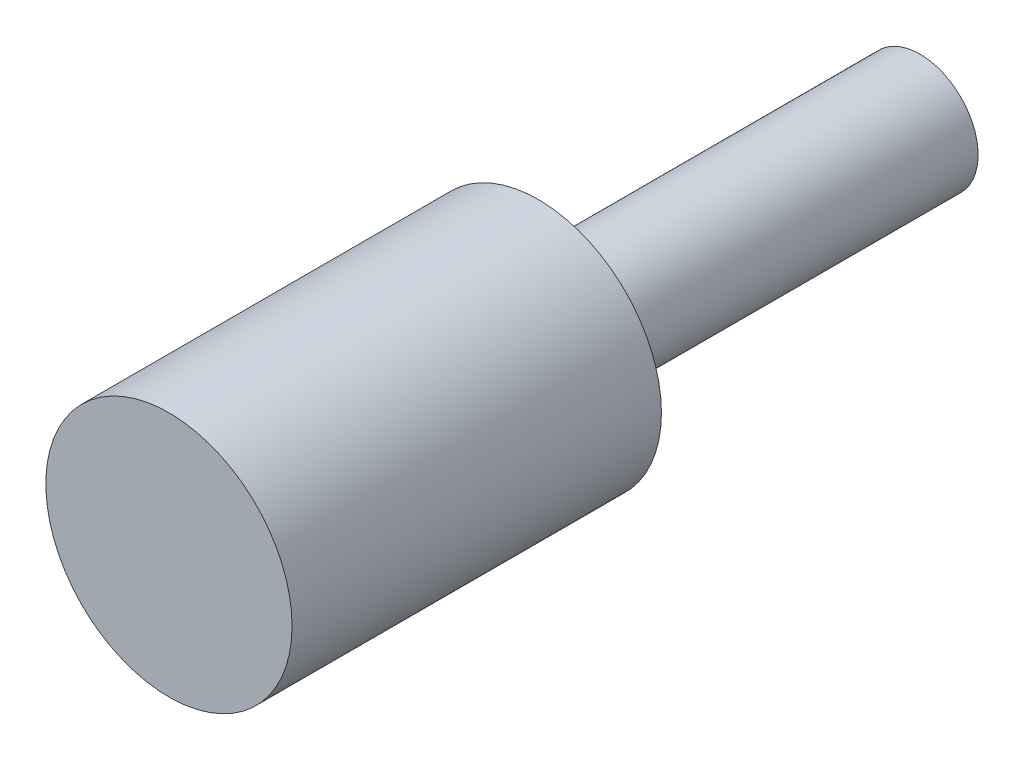
ISO-10303-21;
HEADER;
FILE_DESCRIPTION(('STEP AP214'),'2;1');
FILE_NAME('part.step','',(''),(''),'','','');
FILE_SCHEMA(('AUTOMOTIVE_DESIGN { 1 0 10303 214 1 1 1 1 }'));
ENDSEC;
DATA;
#1=APPLICATION_CONTEXT('core data for automotive mechanical design processes');
#2=APPLICATION_PROTOCOL_DEFINITION('international standard','automotive_design',2000,#1);
#3=PRODUCT_CONTEXT('',#1,'mechanical');
#4=PRODUCT('Part','Part','',(#3));
#5=PRODUCT_RELATED_PRODUCT_CATEGORY('part','',(#4));
#6=PRODUCT_DEFINITION_FORMATION('','',#4);
#7=PRODUCT_DEFINITION_CONTEXT('part definition',#1,'design');
#8=PRODUCT_DEFINITION('design','',#6,#7);
#9=PRODUCT_DEFINITION_SHAPE('','',#8);
#10=(LENGTH_UNIT() NAMED_UNIT(*) SI_UNIT(.MILLI.,.METRE.));
#11=(NAMED_UNIT(*) PLANE_ANGLE_UNIT() SI_UNIT($,.RADIAN.));
#12=(NAMED_UNIT(*) SI_UNIT($,.STERADIAN.) SOLID_ANGLE_UNIT());
#13=UNCERTAINTY_MEASURE_WITH_UNIT(LENGTH_MEASURE(1.E-05),#10,'distance_accuracy_value','');
#14=(GEOMETRIC_REPRESENTATION_CONTEXT(3) GLOBAL_UNCERTAINTY_ASSIGNED_CONTEXT((#13)) GLOBAL_UNIT_ASSIGNED_CONTEXT((#10,
#11,#12)) REPRESENTATION_CONTEXT('',''));
#15=CARTESIAN_POINT('',(0.,0.,0.));
#16=DIRECTION('',(0.,0.,1.));
#17=DIRECTION('',(1.,0.,0.));
#18=AXIS2_PLACEMENT_3D('',#15,#16,#17);
#19=CARTESIAN_POINT('',(0.,0.,30.));
#20=DIRECTION('',(0.,0.,-1.));
#21=DIRECTION('',(-1.,0.,0.));
#22=AXIS2_PLACEMENT_3D('',#19,#20,#21);
#23=CYLINDRICAL_SURFACE('',#22,10.);
#24=CARTESIAN_POINT('',(0.,0.,30.));
#25=DIRECTION('',(0.,0.,1.));
#26=DIRECTION('',(1.,0.,0.));
#27=AXIS2_PLACEMENT_3D('',#24,#25,#26);
#28=CIRCLE('',#27,10.);
#29=CARTESIAN_POINT('',(10.,0.,30.));
#30=VERTEX_POINT('',#29);
#31=EDGE_CURVE('E47',#30,#30,#28,.T.);
#32=ORIENTED_EDGE('',*,*,#31,.F.);
#33=EDGE_LOOP('',(#32));
#34=FACE_BOUND('',#33,.T.);
#35=CARTESIAN_POINT('',(0.,0.,0.));
#36=DIRECTION('',(0.,0.,1.));
#37=DIRECTION('',(1.,0.,0.));
#38=AXIS2_PLACEMENT_3D('',#35,#36,#37);
#39=CIRCLE('',#38,10.);
#40=CARTESIAN_POINT('',(10.,0.,0.));
#41=VERTEX_POINT('',#40);
#42=EDGE_CURVE('E42',#41,#41,#39,.T.);
#43=ORIENTED_EDGE('',*,*,#42,.T.);
#44=EDGE_LOOP('',(#43));
#45=FACE_BOUND('',#44,.T.);
#46=ADVANCED_FACE('F39',(#34,#45),#23,.T.);
#47=CARTESIAN_POINT('',(0.,0.,30.));
#48=DIRECTION('',(0.,0.,1.));
#49=DIRECTION('',(1.,0.,0.));
#50=AXIS2_PLACEMENT_3D('',#47,#48,#49);
#51=PLANE('',#50);
#52=ORIENTED_EDGE('',*,*,#31,.T.);
#53=EDGE_LOOP('',(#52));
#54=FACE_BOUND('',#53,.T.);
#55=ADVANCED_FACE('F67',(#54),#51,.T.);
#56=CARTESIAN_POINT('',(0.,0.,0.));
#57=DIRECTION('',(0.,0.,1.));
#58=DIRECTION('',(1.,0.,0.));
#59=AXIS2_PLACEMENT_3D('',#56,#57,#58);
#60=PLANE('',#59);
#61=CARTESIAN_POINT('',(0.,0.,0.));
#62=DIRECTION('',(0.,0.,-1.));
#63=DIRECTION('',(-1.,0.,0.));
#64=AXIS2_PLACEMENT_3D('',#61,#62,#63);
#65=CIRCLE('',#64,4.72080510909711);
#66=CARTESIAN_POINT('',(-4.72080510909711,0.,0.));
#67=VERTEX_POINT('',#66);
#68=EDGE_CURVE('E10',#67,#67,#65,.T.);
#69=ORIENTED_EDGE('',*,*,#68,.F.);
#70=EDGE_LOOP('',(#69));
#71=FACE_BOUND('',#70,.T.);
#72=ORIENTED_EDGE('',*,*,#42,.F.);
#73=EDGE_LOOP('',(#72));
#74=FACE_BOUND('',#73,.T.);
#75=ADVANCED_FACE('F64',(#71,#74),#60,.F.);
#76=CARTESIAN_POINT('',(0.,0.,-31.));
#77=DIRECTION('',(0.,0.,1.));
#78=DIRECTION('',(1.,0.,0.));
#79=AXIS2_PLACEMENT_3D('',#76,#77,#78);
#80=CYLINDRICAL_SURFACE('',#79,4.72080510909711);
#81=CARTESIAN_POINT('',(0.,0.,-31.));
#82=DIRECTION('',(0.,0.,-1.));
#83=DIRECTION('',(-1.,0.,0.));
#84=AXIS2_PLACEMENT_3D('',#81,#82,#83);
#85=CIRCLE('',#84,4.72080510909711);
#86=CARTESIAN_POINT('',(-4.72080510909711,0.,-31.));
#87=VERTEX_POINT('',#86);
#88=EDGE_CURVE('E54',#87,#87,#85,.T.);
#89=ORIENTED_EDGE('',*,*,#88,.F.);
#90=EDGE_LOOP('',(#89));
#91=FACE_BOUND('',#90,.T.);
#92=ORIENTED_EDGE('',*,*,#68,.T.);
#93=EDGE_LOOP('',(#92));
#94=FACE_BOUND('',#93,.T.);
#95=ADVANCED_FACE('F66',(#91,#94),#80,.T.);
#96=CARTESIAN_POINT('',(0.,0.,-31.));
#97=DIRECTION('',(0.,0.,-1.));
#98=DIRECTION('',(-1.,0.,0.));
#99=AXIS2_PLACEMENT_3D('',#96,#97,#98);
#100=PLANE('',#99);
#101=ORIENTED_EDGE('',*,*,#88,.T.);
#102=EDGE_LOOP('',(#101));
#103=FACE_BOUND('',#102,.T.);
#104=ADVANCED_FACE('F73',(#103),#100,.T.);
#105=CLOSED_SHELL('',(#46,#55,#75,#95,#104));
#106=MANIFOLD_SOLID_BREP('B2',#105);
#107=ADVANCED_BREP_SHAPE_REPRESENTATION('',(#18,#106),#14);
#108=SHAPE_DEFINITION_REPRESENTATION(#9,#107);
ENDSEC;
END-ISO-10303-21;
